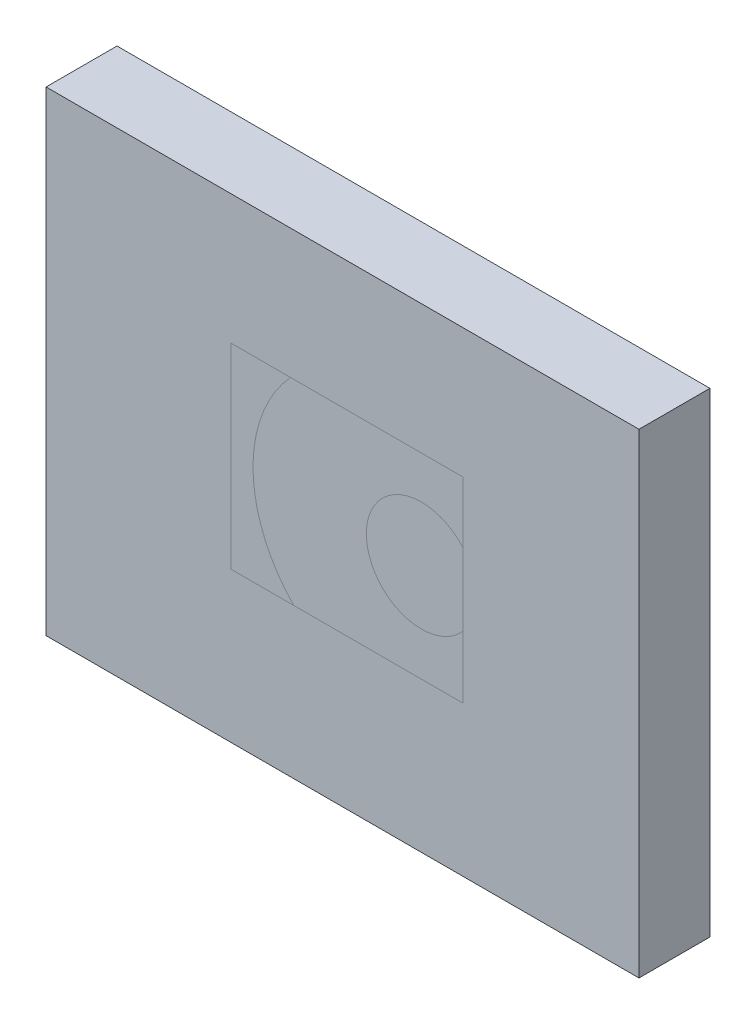
ISO-10303-21;
HEADER;
FILE_DESCRIPTION(('STEP AP214'),'2;1');
FILE_NAME('part.step','',(''),(''),'','','');
FILE_SCHEMA(('AUTOMOTIVE_DESIGN { 1 0 10303 214 1 1 1 1 }'));
ENDSEC;
DATA;
#1=APPLICATION_CONTEXT('core data for automotive mechanical design processes');
#2=APPLICATION_PROTOCOL_DEFINITION('international standard','automotive_design',2000,#1);
#3=PRODUCT_CONTEXT('',#1,'mechanical');
#4=PRODUCT('Part','Part','',(#3));
#5=PRODUCT_RELATED_PRODUCT_CATEGORY('part','',(#4));
#6=PRODUCT_DEFINITION_FORMATION('','',#4);
#7=PRODUCT_DEFINITION_CONTEXT('part definition',#1,'design');
#8=PRODUCT_DEFINITION('design','',#6,#7);
#9=PRODUCT_DEFINITION_SHAPE('','',#8);
#10=(LENGTH_UNIT() NAMED_UNIT(*) SI_UNIT(.MILLI.,.METRE.));
#11=(NAMED_UNIT(*) PLANE_ANGLE_UNIT() SI_UNIT($,.RADIAN.));
#12=(NAMED_UNIT(*) SI_UNIT($,.STERADIAN.) SOLID_ANGLE_UNIT());
#13=UNCERTAINTY_MEASURE_WITH_UNIT(LENGTH_MEASURE(1.E-05),#10,'distance_accuracy_value','');
#14=(GEOMETRIC_REPRESENTATION_CONTEXT(3) GLOBAL_UNCERTAINTY_ASSIGNED_CONTEXT((#13)) GLOBAL_UNIT_ASSIGNED_CONTEXT((#10,
#11,#12)) REPRESENTATION_CONTEXT('',''));
#15=CARTESIAN_POINT('',(0.,0.,0.));
#16=DIRECTION('',(0.,0.,1.));
#17=DIRECTION('',(1.,0.,0.));
#18=AXIS2_PLACEMENT_3D('',#15,#16,#17);
#19=CARTESIAN_POINT('',(0.,0.,0.));
#20=DIRECTION('',(0.,0.,1.));
#21=DIRECTION('',(1.,0.,0.));
#22=AXIS2_PLACEMENT_3D('',#19,#20,#21);
#23=PLANE('',#22);
#24=DIRECTION('',(0.,1.,0.));
#25=VECTOR('',#24,1.);
#26=CARTESIAN_POINT('',(58.1710094689022,48.266893632602,0.));
#27=LINE('',#26,#25);
#28=CARTESIAN_POINT('',(58.1710094689022,20.9365486666092,0.));
#29=VERTEX_POINT('',#28);
#30=CARTESIAN_POINT('',(58.1710094689022,29.6308487723879,0.));
#31=VERTEX_POINT('',#30);
#32=EDGE_CURVE('E66',#29,#31,#27,.T.);
#33=ORIENTED_EDGE('',*,*,#32,.T.);
#34=CARTESIAN_POINT('',(52.3739470938622,34.6683658946903,0.));
#35=DIRECTION('',(0.,0.,1.));
#36=DIRECTION('',(1.,0.,0.));
#37=AXIS2_PLACEMENT_3D('',#34,#35,#36);
#38=CIRCLE('',#37,7.68000722249622);
#39=CARTESIAN_POINT('',(58.1710094689022,39.7058830169927,0.));
#40=VERTEX_POINT('',#39);
#41=EDGE_CURVE('E12',#31,#40,#38,.F.);
#42=ORIENTED_EDGE('',*,*,#41,.T.);
#43=CARTESIAN_POINT('',(58.1710094689022,48.266893632602,0.));
#44=VERTEX_POINT('',#43);
#45=EDGE_CURVE('E83',#40,#44,#27,.T.);
#46=ORIENTED_EDGE('',*,*,#45,.T.);
#47=DIRECTION('',(-1.,0.,0.));
#48=VECTOR('',#47,1.);
#49=CARTESIAN_POINT('',(25.8259223073143,48.266893632602,0.));
#50=LINE('',#49,#48);
#51=CARTESIAN_POINT('',(34.1172050684159,48.266893632602,0.));
#52=VERTEX_POINT('',#51);
#53=EDGE_CURVE('E86',#44,#52,#50,.T.);
#54=ORIENTED_EDGE('',*,*,#53,.T.);
#55=CARTESIAN_POINT('',(48.7095456444073,34.8412629171614,0.));
#56=DIRECTION('',(0.,0.,1.));
#57=DIRECTION('',(1.,0.,0.));
#58=AXIS2_PLACEMENT_3D('',#55,#56,#57);
#59=CIRCLE('',#58,19.8288669266075);
#60=CARTESIAN_POINT('',(34.5729659589388,20.9365486666092,0.));
#61=VERTEX_POINT('',#60);
#62=EDGE_CURVE('E53',#61,#52,#59,.F.);
#63=ORIENTED_EDGE('',*,*,#62,.F.);
#64=DIRECTION('',(1.,0.,0.));
#65=VECTOR('',#64,1.);
#66=CARTESIAN_POINT('',(25.8259223073143,20.9365486666092,0.));
#67=LINE('',#66,#65);
#68=EDGE_CURVE('E98',#61,#29,#67,.T.);
#69=ORIENTED_EDGE('',*,*,#68,.T.);
#70=EDGE_LOOP('',(#33,#42,#46,#54,#63,#69));
#71=FACE_BOUND('',#70,.T.);
#72=ADVANCED_FACE('F47',(#71),#23,.T.);
#73=CARTESIAN_POINT('',(25.8259223073143,20.9365486666092,0.));
#74=VERTEX_POINT('',#73);
#75=EDGE_CURVE('E102',#74,#61,#67,.T.);
#76=ORIENTED_EDGE('',*,*,#75,.T.);
#77=ORIENTED_EDGE('',*,*,#62,.T.);
#78=CARTESIAN_POINT('',(25.8259223073143,48.266893632602,0.));
#79=VERTEX_POINT('',#78);
#80=EDGE_CURVE('E92',#52,#79,#50,.T.);
#81=ORIENTED_EDGE('',*,*,#80,.T.);
#82=DIRECTION('',(0.,-1.,0.));
#83=VECTOR('',#82,1.);
#84=CARTESIAN_POINT('',(25.8259223073143,48.266893632602,0.));
#85=LINE('',#84,#83);
#86=EDGE_CURVE('E91',#79,#74,#85,.T.);
#87=ORIENTED_EDGE('',*,*,#86,.T.);
#88=EDGE_LOOP('',(#76,#77,#81,#87));
#89=FACE_BOUND('',#88,.T.);
#90=ADVANCED_FACE('F110',(#89),#23,.T.);
#91=ORIENTED_EDGE('',*,*,#41,.F.);
#92=EDGE_CURVE('E59',#31,#40,#27,.T.);
#93=ORIENTED_EDGE('',*,*,#92,.T.);
#94=EDGE_LOOP('',(#91,#93));
#95=FACE_BOUND('',#94,.T.);
#96=ADVANCED_FACE('F48',(#95),#23,.T.);
#97=OPEN_SHELL('',(#72,#90,#96));
#98=SHELL_BASED_SURFACE_MODEL('B2',(#97));
#99=CARTESIAN_POINT('',(0.,0.,-9.9));
#100=DIRECTION('',(-1.,0.,0.));
#101=DIRECTION('',(0.,0.,1.));
#102=AXIS2_PLACEMENT_3D('',#99,#100,#101);
#103=PLANE('',#102);
#104=DIRECTION('',(0.,-1.,0.));
#105=VECTOR('',#104,1.);
#106=CARTESIAN_POINT('',(0.,0.,0.));
#107=LINE('',#106,#105);
#108=CARTESIAN_POINT('',(0.,66.3199655367441,0.));
#109=VERTEX_POINT('',#108);
#110=CARTESIAN_POINT('',(0.,0.,0.));
#111=VERTEX_POINT('',#110);
#112=EDGE_CURVE('E263',#109,#111,#107,.T.);
#113=ORIENTED_EDGE('',*,*,#112,.F.);
#114=DIRECTION('',(0.,0.,1.));
#115=VECTOR('',#114,1.);
#116=CARTESIAN_POINT('',(0.,66.3199655367441,-9.9));
#117=LINE('',#116,#115);
#118=CARTESIAN_POINT('',(0.,66.3199655367441,-9.9));
#119=VERTEX_POINT('',#118);
#120=EDGE_CURVE('E45',#119,#109,#117,.T.);
#121=ORIENTED_EDGE('',*,*,#120,.F.);
#122=DIRECTION('',(0.,-1.,0.));
#123=VECTOR('',#122,1.);
#124=CARTESIAN_POINT('',(0.,0.,-9.9));
#125=LINE('',#124,#123);
#126=CARTESIAN_POINT('',(0.,0.,-9.9));
#127=VERTEX_POINT('',#126);
#128=EDGE_CURVE('E267',#119,#127,#125,.T.);
#129=ORIENTED_EDGE('',*,*,#128,.T.);
#130=DIRECTION('',(0.,0.,1.));
#131=VECTOR('',#130,1.);
#132=CARTESIAN_POINT('',(0.,0.,-9.9));
#133=LINE('',#132,#131);
#134=EDGE_CURVE('E168',#127,#111,#133,.T.);
#135=ORIENTED_EDGE('',*,*,#134,.T.);
#136=EDGE_LOOP('',(#113,#121,#129,#135));
#137=FACE_BOUND('',#136,.T.);
#138=ADVANCED_FACE('F165',(#137),#103,.T.);
#139=CARTESIAN_POINT('',(0.,66.3199655367441,-9.9));
#140=DIRECTION('',(0.,1.,0.));
#141=DIRECTION('',(0.,0.,1.));
#142=AXIS2_PLACEMENT_3D('',#139,#140,#141);
#143=PLANE('',#142);
#144=DIRECTION('',(-1.,0.,0.));
#145=VECTOR('',#144,1.);
#146=CARTESIAN_POINT('',(0.,66.3199655367441,0.));
#147=LINE('',#146,#145);
#148=CARTESIAN_POINT('',(82.7432462273178,66.3199655367441,0.));
#149=VERTEX_POINT('',#148);
#150=EDGE_CURVE('E271',#149,#109,#147,.T.);
#151=ORIENTED_EDGE('',*,*,#150,.F.);
#152=DIRECTION('',(0.,0.,1.));
#153=VECTOR('',#152,1.);
#154=CARTESIAN_POINT('',(82.7432462273178,66.3199655367441,-9.9));
#155=LINE('',#154,#153);
#156=CARTESIAN_POINT('',(82.7432462273178,66.3199655367441,-9.9));
#157=VERTEX_POINT('',#156);
#158=EDGE_CURVE('E173',#157,#149,#155,.T.);
#159=ORIENTED_EDGE('',*,*,#158,.F.);
#160=DIRECTION('',(-1.,0.,0.));
#161=VECTOR('',#160,1.);
#162=CARTESIAN_POINT('',(0.,66.3199655367441,-9.9));
#163=LINE('',#162,#161);
#164=EDGE_CURVE('E277',#157,#119,#163,.T.);
#165=ORIENTED_EDGE('',*,*,#164,.T.);
#166=ORIENTED_EDGE('',*,*,#120,.T.);
#167=EDGE_LOOP('',(#151,#159,#165,#166));
#168=FACE_BOUND('',#167,.T.);
#169=ADVANCED_FACE('F303',(#168),#143,.T.);
#170=CARTESIAN_POINT('',(82.7432462273178,0.,-9.9));
#171=DIRECTION('',(1.,0.,0.));
#172=DIRECTION('',(0.,0.,-1.));
#173=AXIS2_PLACEMENT_3D('',#170,#171,#172);
#174=PLANE('',#173);
#175=DIRECTION('',(0.,1.,0.));
#176=VECTOR('',#175,1.);
#177=CARTESIAN_POINT('',(82.7432462273178,0.,0.));
#178=LINE('',#177,#176);
#179=CARTESIAN_POINT('',(82.7432462273178,0.,0.));
#180=VERTEX_POINT('',#179);
#181=EDGE_CURVE('E285',#180,#149,#178,.T.);
#182=ORIENTED_EDGE('',*,*,#181,.F.);
#183=DIRECTION('',(0.,0.,1.));
#184=VECTOR('',#183,1.);
#185=CARTESIAN_POINT('',(82.7432462273178,0.,-9.9));
#186=LINE('',#185,#184);
#187=CARTESIAN_POINT('',(82.7432462273178,0.,-9.9));
#188=VERTEX_POINT('',#187);
#189=EDGE_CURVE('E290',#188,#180,#186,.T.);
#190=ORIENTED_EDGE('',*,*,#189,.F.);
#191=DIRECTION('',(0.,1.,0.));
#192=VECTOR('',#191,1.);
#193=CARTESIAN_POINT('',(82.7432462273178,0.,-9.9));
#194=LINE('',#193,#192);
#195=EDGE_CURVE('E274',#188,#157,#194,.T.);
#196=ORIENTED_EDGE('',*,*,#195,.T.);
#197=ORIENTED_EDGE('',*,*,#158,.T.);
#198=EDGE_LOOP('',(#182,#190,#196,#197));
#199=FACE_BOUND('',#198,.T.);
#200=ADVANCED_FACE('F307',(#199),#174,.T.);
#201=CARTESIAN_POINT('',(0.,0.,-9.9));
#202=DIRECTION('',(0.,-1.,0.));
#203=DIRECTION('',(0.,0.,-1.));
#204=AXIS2_PLACEMENT_3D('',#201,#202,#203);
#205=PLANE('',#204);
#206=DIRECTION('',(1.,0.,0.));
#207=VECTOR('',#206,1.);
#208=CARTESIAN_POINT('',(0.,0.,0.));
#209=LINE('',#208,#207);
#210=EDGE_CURVE('E282',#111,#180,#209,.T.);
#211=ORIENTED_EDGE('',*,*,#210,.F.);
#212=ORIENTED_EDGE('',*,*,#134,.F.);
#213=DIRECTION('',(1.,0.,0.));
#214=VECTOR('',#213,1.);
#215=CARTESIAN_POINT('',(0.,0.,-9.9));
#216=LINE('',#215,#214);
#217=EDGE_CURVE('E270',#127,#188,#216,.T.);
#218=ORIENTED_EDGE('',*,*,#217,.T.);
#219=ORIENTED_EDGE('',*,*,#189,.T.);
#220=EDGE_LOOP('',(#211,#212,#218,#219));
#221=FACE_BOUND('',#220,.T.);
#222=ADVANCED_FACE('F298',(#221),#205,.T.);
#223=CARTESIAN_POINT('',(0.,0.,-9.9));
#224=DIRECTION('',(0.,0.,-1.));
#225=DIRECTION('',(-1.,0.,0.));
#226=AXIS2_PLACEMENT_3D('',#223,#224,#225);
#227=PLANE('',#226);
#228=DIRECTION('',(0.,-1.,0.));
#229=VECTOR('',#228,1.);
#230=CARTESIAN_POINT('',(25.8259223073143,48.266893632602,-9.9));
#231=LINE('',#230,#229);
#232=CARTESIAN_POINT('',(25.8259223073143,48.266893632602,-9.9));
#233=VERTEX_POINT('',#232);
#234=CARTESIAN_POINT('',(25.8259223073143,20.9365486666092,-9.9));
#235=VERTEX_POINT('',#234);
#236=EDGE_CURVE('E232',#233,#235,#231,.T.);
#237=ORIENTED_EDGE('',*,*,#236,.T.);
#238=DIRECTION('',(1.,0.,0.));
#239=VECTOR('',#238,1.);
#240=CARTESIAN_POINT('',(25.8259223073143,20.9365486666092,-9.9));
#241=LINE('',#240,#239);
#242=CARTESIAN_POINT('',(58.1710094689022,20.9365486666092,-9.9));
#243=VERTEX_POINT('',#242);
#244=EDGE_CURVE('E241',#235,#243,#241,.T.);
#245=ORIENTED_EDGE('',*,*,#244,.T.);
#246=DIRECTION('',(0.,1.,0.));
#247=VECTOR('',#246,1.);
#248=CARTESIAN_POINT('',(58.1710094689022,48.266893632602,-9.9));
#249=LINE('',#248,#247);
#250=CARTESIAN_POINT('',(58.1710094689022,48.266893632602,-9.9));
#251=VERTEX_POINT('',#250);
#252=EDGE_CURVE('E181',#243,#251,#249,.T.);
#253=ORIENTED_EDGE('',*,*,#252,.T.);
#254=DIRECTION('',(-1.,0.,0.));
#255=VECTOR('',#254,1.);
#256=CARTESIAN_POINT('',(25.8259223073143,48.266893632602,-9.9));
#257=LINE('',#256,#255);
#258=EDGE_CURVE('E238',#251,#233,#257,.T.);
#259=ORIENTED_EDGE('',*,*,#258,.T.);
#260=EDGE_LOOP('',(#237,#245,#253,#259));
#261=FACE_BOUND('',#260,.T.);
#262=ORIENTED_EDGE('',*,*,#128,.F.);
#263=ORIENTED_EDGE('',*,*,#164,.F.);
#264=ORIENTED_EDGE('',*,*,#195,.F.);
#265=ORIENTED_EDGE('',*,*,#217,.F.);
#266=EDGE_LOOP('',(#262,#263,#264,#265));
#267=FACE_BOUND('',#266,.T.);
#268=ADVANCED_FACE('F245',(#261,#267),#227,.T.);
#269=CARTESIAN_POINT('',(0.,0.,0.));
#270=DIRECTION('',(0.,0.,-1.));
#271=DIRECTION('',(-1.,0.,0.));
#272=AXIS2_PLACEMENT_3D('',#269,#270,#271);
#273=PLANE('',#272);
#274=DIRECTION('',(1.,0.,0.));
#275=VECTOR('',#274,1.);
#276=CARTESIAN_POINT('',(25.8259223073143,20.9365486666092,0.));
#277=LINE('',#276,#275);
#278=CARTESIAN_POINT('',(25.8259223073143,20.9365486666092,0.));
#279=VERTEX_POINT('',#278);
#280=CARTESIAN_POINT('',(58.1710094689022,20.9365486666092,0.));
#281=VERTEX_POINT('',#280);
#282=EDGE_CURVE('E257',#279,#281,#277,.T.);
#283=ORIENTED_EDGE('',*,*,#282,.F.);
#284=DIRECTION('',(0.,-1.,0.));
#285=VECTOR('',#284,1.);
#286=CARTESIAN_POINT('',(25.8259223073143,48.266893632602,0.));
#287=LINE('',#286,#285);
#288=CARTESIAN_POINT('',(25.8259223073143,48.266893632602,0.));
#289=VERTEX_POINT('',#288);
#290=EDGE_CURVE('E189',#289,#279,#287,.T.);
#291=ORIENTED_EDGE('',*,*,#290,.F.);
#292=DIRECTION('',(-1.,0.,0.));
#293=VECTOR('',#292,1.);
#294=CARTESIAN_POINT('',(25.8259223073143,48.266893632602,0.));
#295=LINE('',#294,#293);
#296=CARTESIAN_POINT('',(58.1710094689022,48.266893632602,0.));
#297=VERTEX_POINT('',#296);
#298=EDGE_CURVE('E248',#297,#289,#295,.T.);
#299=ORIENTED_EDGE('',*,*,#298,.F.);
#300=DIRECTION('',(0.,1.,0.));
#301=VECTOR('',#300,1.);
#302=CARTESIAN_POINT('',(58.1710094689022,48.266893632602,0.));
#303=LINE('',#302,#301);
#304=EDGE_CURVE('E251',#281,#297,#303,.T.);
#305=ORIENTED_EDGE('',*,*,#304,.F.);
#306=EDGE_LOOP('',(#283,#291,#299,#305));
#307=FACE_BOUND('',#306,.T.);
#308=ORIENTED_EDGE('',*,*,#112,.T.);
#309=ORIENTED_EDGE('',*,*,#210,.T.);
#310=ORIENTED_EDGE('',*,*,#181,.T.);
#311=ORIENTED_EDGE('',*,*,#150,.T.);
#312=EDGE_LOOP('',(#308,#309,#310,#311));
#313=FACE_BOUND('',#312,.T.);
#314=ADVANCED_FACE('F300',(#307,#313),#273,.F.);
#315=CARTESIAN_POINT('',(25.8259223073143,48.266893632602,-9.9));
#316=DIRECTION('',(-1.,0.,0.));
#317=DIRECTION('',(0.,0.,1.));
#318=AXIS2_PLACEMENT_3D('',#315,#316,#317);
#319=PLANE('',#318);
#320=ORIENTED_EDGE('',*,*,#290,.T.);
#321=DIRECTION('',(0.,0.,1.));
#322=VECTOR('',#321,1.);
#323=CARTESIAN_POINT('',(25.8259223073143,20.9365486666092,-9.9));
#324=LINE('',#323,#322);
#325=EDGE_CURVE('E228',#235,#279,#324,.T.);
#326=ORIENTED_EDGE('',*,*,#325,.F.);
#327=ORIENTED_EDGE('',*,*,#236,.F.);
#328=DIRECTION('',(0.,0.,1.));
#329=VECTOR('',#328,1.);
#330=CARTESIAN_POINT('',(25.8259223073143,48.266893632602,-9.9));
#331=LINE('',#330,#329);
#332=EDGE_CURVE('E261',#233,#289,#331,.T.);
#333=ORIENTED_EDGE('',*,*,#332,.T.);
#334=EDGE_LOOP('',(#320,#326,#327,#333));
#335=FACE_BOUND('',#334,.T.);
#336=ADVANCED_FACE('F230',(#335),#319,.F.);
#337=CARTESIAN_POINT('',(25.8259223073143,48.266893632602,-9.9));
#338=DIRECTION('',(0.,1.,0.));
#339=DIRECTION('',(0.,0.,1.));
#340=AXIS2_PLACEMENT_3D('',#337,#338,#339);
#341=PLANE('',#340);
#342=ORIENTED_EDGE('',*,*,#298,.T.);
#343=ORIENTED_EDGE('',*,*,#332,.F.);
#344=ORIENTED_EDGE('',*,*,#258,.F.);
#345=DIRECTION('',(0.,0.,1.));
#346=VECTOR('',#345,1.);
#347=CARTESIAN_POINT('',(58.1710094689022,48.266893632602,-9.9));
#348=LINE('',#347,#346);
#349=EDGE_CURVE('E264',#251,#297,#348,.T.);
#350=ORIENTED_EDGE('',*,*,#349,.T.);
#351=EDGE_LOOP('',(#342,#343,#344,#350));
#352=FACE_BOUND('',#351,.T.);
#353=ADVANCED_FACE('F358',(#352),#341,.F.);
#354=CARTESIAN_POINT('',(58.1710094689022,48.266893632602,-9.9));
#355=DIRECTION('',(1.,0.,0.));
#356=DIRECTION('',(0.,0.,-1.));
#357=AXIS2_PLACEMENT_3D('',#354,#355,#356);
#358=PLANE('',#357);
#359=ORIENTED_EDGE('',*,*,#304,.T.);
#360=ORIENTED_EDGE('',*,*,#349,.F.);
#361=ORIENTED_EDGE('',*,*,#252,.F.);
#362=DIRECTION('',(0.,0.,1.));
#363=VECTOR('',#362,1.);
#364=CARTESIAN_POINT('',(58.1710094689022,20.9365486666092,-9.9));
#365=LINE('',#364,#363);
#366=EDGE_CURVE('E237',#243,#281,#365,.T.);
#367=ORIENTED_EDGE('',*,*,#366,.T.);
#368=EDGE_LOOP('',(#359,#360,#361,#367));
#369=FACE_BOUND('',#368,.T.);
#370=ADVANCED_FACE('F367',(#369),#358,.F.);
#371=CARTESIAN_POINT('',(25.8259223073143,20.9365486666092,-9.9));
#372=DIRECTION('',(0.,-1.,0.));
#373=DIRECTION('',(0.,0.,-1.));
#374=AXIS2_PLACEMENT_3D('',#371,#372,#373);
#375=PLANE('',#374);
#376=ORIENTED_EDGE('',*,*,#282,.T.);
#377=ORIENTED_EDGE('',*,*,#366,.F.);
#378=ORIENTED_EDGE('',*,*,#244,.F.);
#379=ORIENTED_EDGE('',*,*,#325,.T.);
#380=EDGE_LOOP('',(#376,#377,#378,#379));
#381=FACE_BOUND('',#380,.T.);
#382=ADVANCED_FACE('F242',(#381),#375,.F.);
#383=CLOSED_SHELL('',(#138,#169,#200,#222,#268,#314,#336,#353,#370,#382));
#384=MANIFOLD_SOLID_BREP('B6',#383);
#385=ADVANCED_BREP_SHAPE_REPRESENTATION('',(#18,#384),#14);
#386=MANIFOLD_SURFACE_SHAPE_REPRESENTATION('',(#18,#98),#14);
#387=SHAPE_REPRESENTATION('',(#18),#14);
#388=SHAPE_DEFINITION_REPRESENTATION(#9,#387);
#389=SHAPE_REPRESENTATION_RELATIONSHIP('','',#387,#385);
#390=SHAPE_REPRESENTATION_RELATIONSHIP('','',#387,#386);
ENDSEC;
END-ISO-10303-21;
